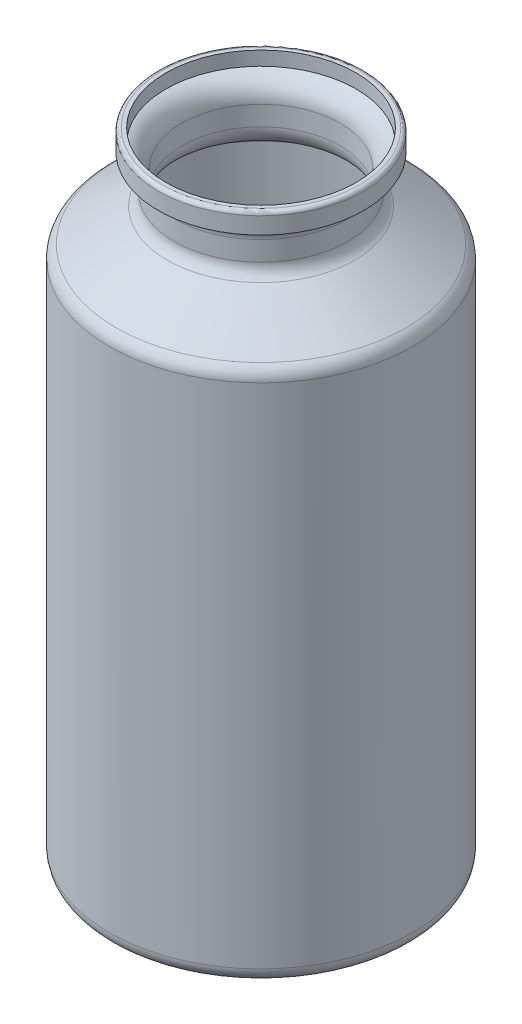
ISO-10303-21;
HEADER;
FILE_DESCRIPTION(('STEP AP214'),'2;1');
FILE_NAME('part.step','',(''),(''),'','','');
FILE_SCHEMA(('AUTOMOTIVE_DESIGN { 1 0 10303 214 1 1 1 1 }'));
ENDSEC;
DATA;
#1=APPLICATION_CONTEXT('core data for automotive mechanical design processes');
#2=APPLICATION_PROTOCOL_DEFINITION('international standard','automotive_design',2000,#1);
#3=PRODUCT_CONTEXT('',#1,'mechanical');
#4=PRODUCT('Part','Part','',(#3));
#5=PRODUCT_RELATED_PRODUCT_CATEGORY('part','',(#4));
#6=PRODUCT_DEFINITION_FORMATION('','',#4);
#7=PRODUCT_DEFINITION_CONTEXT('part definition',#1,'design');
#8=PRODUCT_DEFINITION('design','',#6,#7);
#9=PRODUCT_DEFINITION_SHAPE('','',#8);
#10=(LENGTH_UNIT() NAMED_UNIT(*) SI_UNIT(.MILLI.,.METRE.));
#11=(NAMED_UNIT(*) PLANE_ANGLE_UNIT() SI_UNIT($,.RADIAN.));
#12=(NAMED_UNIT(*) SI_UNIT($,.STERADIAN.) SOLID_ANGLE_UNIT());
#13=UNCERTAINTY_MEASURE_WITH_UNIT(LENGTH_MEASURE(1.E-05),#10,'distance_accuracy_value','');
#14=(GEOMETRIC_REPRESENTATION_CONTEXT(3) GLOBAL_UNCERTAINTY_ASSIGNED_CONTEXT((#13)) GLOBAL_UNIT_ASSIGNED_CONTEXT((#10,
#11,#12)) REPRESENTATION_CONTEXT('',''));
#15=CARTESIAN_POINT('',(0.,0.,0.));
#16=DIRECTION('',(0.,0.,1.));
#17=DIRECTION('',(1.,0.,0.));
#18=AXIS2_PLACEMENT_3D('',#15,#16,#17);
#19=CARTESIAN_POINT('',(0.,-74.1935483870968,0.));
#20=DIRECTION('',(0.,-1.,0.));
#21=DIRECTION('',(0.,0.,-1.));
#22=AXIS2_PLACEMENT_3D('',#19,#20,#21);
#23=CYLINDRICAL_SURFACE('',#22,40.);
#24=CARTESIAN_POINT('',(0.,63.6314493791361,0.));
#25=DIRECTION('',(0.,1.,0.));
#26=DIRECTION('',(0.,0.,1.));
#27=AXIS2_PLACEMENT_3D('',#24,#25,#26);
#28=CIRCLE('',#27,40.);
#29=CARTESIAN_POINT('',(0.,63.6314493791361,40.));
#30=VERTEX_POINT('',#29);
#31=EDGE_CURVE('E61',#30,#30,#28,.F.);
#32=ORIENTED_EDGE('',*,*,#31,.T.);
#33=EDGE_LOOP('',(#32));
#34=FACE_BOUND('',#33,.T.);
#35=CARTESIAN_POINT('',(0.,-70.1935483870968,0.));
#36=DIRECTION('',(0.,-1.,0.));
#37=DIRECTION('',(0.,0.,-1.));
#38=AXIS2_PLACEMENT_3D('',#35,#36,#37);
#39=CIRCLE('',#38,40.);
#40=CARTESIAN_POINT('',(0.,-70.1935483870968,-40.));
#41=VERTEX_POINT('',#40);
#42=EDGE_CURVE('E67',#41,#41,#39,.F.);
#43=ORIENTED_EDGE('',*,*,#42,.T.);
#44=EDGE_LOOP('',(#43));
#45=FACE_BOUND('',#44,.T.);
#46=ADVANCED_FACE('F43',(#34,#45),#23,.T.);
#47=CARTESIAN_POINT('',(0.,65.8064516129032,0.));
#48=DIRECTION('',(0.,-1.,0.));
#49=DIRECTION('',(0.,0.,-1.));
#50=AXIS2_PLACEMENT_3D('',#47,#48,#49);
#51=CONICAL_SURFACE('',#50,40.,0.996065034323137);
#52=CARTESIAN_POINT('',(0.,75.7109418218179,0.));
#53=DIRECTION('',(0.,-1.,0.));
#54=DIRECTION('',(0.,0.,-1.));
#55=AXIS2_PLACEMENT_3D('',#52,#53,#54);
#56=CIRCLE('',#55,24.7073635204609);
#57=CARTESIAN_POINT('',(0.,75.7109418218179,-24.7073635204609));
#58=VERTEX_POINT('',#57);
#59=EDGE_CURVE('E71',#58,#58,#56,.T.);
#60=ORIENTED_EDGE('',*,*,#59,.T.);
#61=EDGE_LOOP('',(#60));
#62=FACE_BOUND('',#61,.T.);
#63=CARTESIAN_POINT('',(0.,66.9888029976356,0.));
#64=DIRECTION('',(0.,1.,0.));
#65=DIRECTION('',(0.,0.,1.));
#66=AXIS2_PLACEMENT_3D('',#63,#64,#65);
#67=CIRCLE('',#66,38.1744370950544);
#68=CARTESIAN_POINT('',(0.,66.9888029976356,38.1744370950544));
#69=VERTEX_POINT('',#68);
#70=EDGE_CURVE('E75',#69,#69,#67,.T.);
#71=ORIENTED_EDGE('',*,*,#70,.T.);
#72=EDGE_LOOP('',(#71));
#73=FACE_BOUND('',#72,.T.);
#74=ADVANCED_FACE('F164',(#62,#73),#51,.T.);
#75=CARTESIAN_POINT('',(0.,-74.1935483870968,0.));
#76=DIRECTION('',(0.,-1.,0.));
#77=DIRECTION('',(0.,0.,-1.));
#78=AXIS2_PLACEMENT_3D('',#75,#76,#77);
#79=CYLINDRICAL_SURFACE('',#78,22.8818006155153);
#80=CARTESIAN_POINT('',(0.,84.2281667121134,0.));
#81=DIRECTION('',(0.,-1.,0.));
#82=DIRECTION('',(0.,0.,-1.));
#83=AXIS2_PLACEMENT_3D('',#80,#81,#82);
#84=CIRCLE('',#83,22.8818006155153);
#85=CARTESIAN_POINT('',(0.,84.2281667121134,-22.8818006155153));
#86=VERTEX_POINT('',#85);
#87=EDGE_CURVE('E83',#86,#86,#84,.T.);
#88=ORIENTED_EDGE('',*,*,#87,.T.);
#89=EDGE_LOOP('',(#88));
#90=FACE_BOUND('',#89,.T.);
#91=CARTESIAN_POINT('',(0.,79.0682954403173,0.));
#92=DIRECTION('',(0.,-1.,0.));
#93=DIRECTION('',(0.,0.,-1.));
#94=AXIS2_PLACEMENT_3D('',#91,#92,#93);
#95=CIRCLE('',#94,22.8818006155153);
#96=CARTESIAN_POINT('',(0.,79.0682954403173,-22.8818006155153));
#97=VERTEX_POINT('',#96);
#98=EDGE_CURVE('E87',#97,#97,#95,.F.);
#99=ORIENTED_EDGE('',*,*,#98,.T.);
#100=EDGE_LOOP('',(#99));
#101=FACE_BOUND('',#100,.T.);
#102=ADVANCED_FACE('F170',(#90,#101),#79,.T.);
#103=CARTESIAN_POINT('',(22.8818006155153,88.2281667121134,0.));
#104=DIRECTION('',(0.,-1.,0.));
#105=DIRECTION('',(0.,0.,-1.));
#106=AXIS2_PLACEMENT_3D('',#103,#104,#105);
#107=PLANE('',#106);
#108=CARTESIAN_POINT('',(0.,88.2281667121134,0.));
#109=DIRECTION('',(0.,-1.,0.));
#110=DIRECTION('',(0.,0.,-1.));
#111=AXIS2_PLACEMENT_3D('',#108,#109,#110);
#112=CIRCLE('',#111,26.8818006155153);
#113=CARTESIAN_POINT('',(0.,88.2281667121134,-26.8818006155153));
#114=VERTEX_POINT('',#113);
#115=EDGE_CURVE('E79',#114,#114,#112,.F.);
#116=ORIENTED_EDGE('',*,*,#115,.T.);
#117=EDGE_LOOP('',(#116));
#118=FACE_BOUND('',#117,.T.);
#119=CARTESIAN_POINT('',(0.,88.2281667121134,0.));
#120=DIRECTION('',(0.,-1.,0.));
#121=DIRECTION('',(0.,0.,-1.));
#122=AXIS2_PLACEMENT_3D('',#119,#120,#121);
#123=CIRCLE('',#122,27.0669846791079);
#124=CARTESIAN_POINT('',(0.,88.2281667121134,-27.0669846791079));
#125=VERTEX_POINT('',#124);
#126=EDGE_CURVE('E91',#125,#125,#123,.T.);
#127=ORIENTED_EDGE('',*,*,#126,.T.);
#128=EDGE_LOOP('',(#127));
#129=FACE_BOUND('',#128,.T.);
#130=ADVANCED_FACE('F211',(#118,#129),#107,.T.);
#131=CARTESIAN_POINT('',(0.,-74.1935483870968,0.));
#132=DIRECTION('',(0.,-1.,0.));
#133=DIRECTION('',(0.,0.,-1.));
#134=AXIS2_PLACEMENT_3D('',#131,#132,#133);
#135=CYLINDRICAL_SURFACE('',#134,27.0669846791079);
#136=CARTESIAN_POINT('',(0.,92.6340294609205,0.));
#137=DIRECTION('',(0.,1.,0.));
#138=DIRECTION('',(0.,0.,1.));
#139=AXIS2_PLACEMENT_3D('',#136,#137,#138);
#140=CIRCLE('',#139,27.0669846791079);
#141=CARTESIAN_POINT('',(0.,92.6340294609205,27.0669846791079));
#142=VERTEX_POINT('',#141);
#143=EDGE_CURVE('E51',#142,#142,#140,.F.);
#144=ORIENTED_EDGE('',*,*,#143,.T.);
#145=EDGE_LOOP('',(#144));
#146=FACE_BOUND('',#145,.T.);
#147=ORIENTED_EDGE('',*,*,#126,.F.);
#148=EDGE_LOOP('',(#147));
#149=FACE_BOUND('',#148,.T.);
#150=ADVANCED_FACE('F205',(#146,#149),#135,.T.);
#151=CARTESIAN_POINT('',(0.,93.6340294609205,0.));
#152=DIRECTION('',(0.,1.,0.));
#153=DIRECTION('',(0.,0.,1.));
#154=AXIS2_PLACEMENT_3D('',#151,#152,#153);
#155=PLANE('',#154);
#156=CARTESIAN_POINT('',(0.,93.6340294609205,0.));
#157=DIRECTION('',(0.,1.,0.));
#158=DIRECTION('',(0.,0.,1.));
#159=AXIS2_PLACEMENT_3D('',#156,#157,#158);
#160=CIRCLE('',#159,25.0669846791079);
#161=CARTESIAN_POINT('',(0.,93.6340294609205,25.0669846791079));
#162=VERTEX_POINT('',#161);
#163=EDGE_CURVE('E95',#162,#162,#160,.F.);
#164=ORIENTED_EDGE('',*,*,#163,.T.);
#165=EDGE_LOOP('',(#164));
#166=FACE_BOUND('',#165,.T.);
#167=CARTESIAN_POINT('',(0.,93.6340294609205,0.));
#168=DIRECTION('',(0.,1.,0.));
#169=DIRECTION('',(0.,0.,1.));
#170=AXIS2_PLACEMENT_3D('',#167,#168,#169);
#171=CIRCLE('',#170,26.0669846791079);
#172=CARTESIAN_POINT('',(0.,93.6340294609205,26.0669846791079));
#173=VERTEX_POINT('',#172);
#174=EDGE_CURVE('E12',#173,#173,#171,.T.);
#175=ORIENTED_EDGE('',*,*,#174,.T.);
#176=EDGE_LOOP('',(#175));
#177=FACE_BOUND('',#176,.T.);
#178=ADVANCED_FACE('F200',(#166,#177),#155,.T.);
#179=CARTESIAN_POINT('',(0.,-74.1935483870968,0.));
#180=DIRECTION('',(0.,-1.,0.));
#181=DIRECTION('',(0.,0.,-1.));
#182=AXIS2_PLACEMENT_3D('',#179,#180,#181);
#183=PLANE('',#182);
#184=CARTESIAN_POINT('',(0.,-74.1935483870968,0.));
#185=DIRECTION('',(0.,-1.,0.));
#186=DIRECTION('',(0.,0.,-1.));
#187=AXIS2_PLACEMENT_3D('',#184,#185,#186);
#188=CIRCLE('',#187,36.);
#189=CARTESIAN_POINT('',(0.,-74.1935483870968,-36.));
#190=VERTEX_POINT('',#189);
#191=EDGE_CURVE('E56',#190,#190,#188,.T.);
#192=ORIENTED_EDGE('',*,*,#191,.T.);
#193=EDGE_LOOP('',(#192));
#194=FACE_BOUND('',#193,.T.);
#195=ADVANCED_FACE('F180',(#194),#183,.T.);
#196=CARTESIAN_POINT('',(0.,84.2281667121134,0.));
#197=DIRECTION('',(0.,-1.,0.));
#198=DIRECTION('',(0.,0.,-1.));
#199=AXIS2_PLACEMENT_3D('',#196,#197,#198);
#200=TOROIDAL_SURFACE('',#199,26.8818006155153,4.);
#201=ORIENTED_EDGE('',*,*,#115,.F.);
#202=EDGE_LOOP('',(#201));
#203=FACE_BOUND('',#202,.T.);
#204=ORIENTED_EDGE('',*,*,#87,.F.);
#205=EDGE_LOOP('',(#204));
#206=FACE_BOUND('',#205,.T.);
#207=ADVANCED_FACE('F176',(#203,#206),#200,.F.);
#208=CARTESIAN_POINT('',(0.,79.0682954403173,0.));
#209=DIRECTION('',(0.,-1.,0.));
#210=DIRECTION('',(0.,0.,-1.));
#211=AXIS2_PLACEMENT_3D('',#208,#209,#210);
#212=TOROIDAL_SURFACE('',#211,26.8818006155153,4.);
#213=ORIENTED_EDGE('',*,*,#98,.F.);
#214=EDGE_LOOP('',(#213));
#215=FACE_BOUND('',#214,.T.);
#216=ORIENTED_EDGE('',*,*,#59,.F.);
#217=EDGE_LOOP('',(#216));
#218=FACE_BOUND('',#217,.T.);
#219=ADVANCED_FACE('F179',(#215,#218),#212,.F.);
#220=CARTESIAN_POINT('',(0.,63.6314493791361,0.));
#221=DIRECTION('',(0.,1.,0.));
#222=DIRECTION('',(0.,0.,1.));
#223=AXIS2_PLACEMENT_3D('',#220,#221,#222);
#224=TOROIDAL_SURFACE('',#223,36.,4.);
#225=ORIENTED_EDGE('',*,*,#70,.F.);
#226=EDGE_LOOP('',(#225));
#227=FACE_BOUND('',#226,.T.);
#228=ORIENTED_EDGE('',*,*,#31,.F.);
#229=EDGE_LOOP('',(#228));
#230=FACE_BOUND('',#229,.T.);
#231=ADVANCED_FACE('F184',(#227,#230),#224,.T.);
#232=CARTESIAN_POINT('',(0.,-70.1935483870968,0.));
#233=DIRECTION('',(0.,-1.,0.));
#234=DIRECTION('',(0.,0.,-1.));
#235=AXIS2_PLACEMENT_3D('',#232,#233,#234);
#236=TOROIDAL_SURFACE('',#235,36.,4.);
#237=ORIENTED_EDGE('',*,*,#42,.F.);
#238=EDGE_LOOP('',(#237));
#239=FACE_BOUND('',#238,.T.);
#240=ORIENTED_EDGE('',*,*,#191,.F.);
#241=EDGE_LOOP('',(#240));
#242=FACE_BOUND('',#241,.T.);
#243=ADVANCED_FACE('F187',(#239,#242),#236,.T.);
#244=CARTESIAN_POINT('',(0.,92.6340294609205,0.));
#245=DIRECTION('',(0.,1.,0.));
#246=DIRECTION('',(0.,0.,1.));
#247=AXIS2_PLACEMENT_3D('',#244,#245,#246);
#248=TOROIDAL_SURFACE('',#247,26.0669846791079,1.);
#249=ORIENTED_EDGE('',*,*,#174,.F.);
#250=EDGE_LOOP('',(#249));
#251=FACE_BOUND('',#250,.T.);
#252=ORIENTED_EDGE('',*,*,#143,.F.);
#253=EDGE_LOOP('',(#252));
#254=FACE_BOUND('',#253,.T.);
#255=ADVANCED_FACE('F45',(#251,#254),#248,.T.);
#256=CARTESIAN_POINT('',(0.,-74.1935483870968,0.));
#257=DIRECTION('',(0.,-1.,0.));
#258=DIRECTION('',(0.,0.,-1.));
#259=AXIS2_PLACEMENT_3D('',#256,#257,#258);
#260=CYLINDRICAL_SURFACE('',#259,38.);
#261=CARTESIAN_POINT('',(0.,63.6314493791361,0.));
#262=DIRECTION('',(0.,-1.,0.));
#263=DIRECTION('',(0.,0.,-1.));
#264=AXIS2_PLACEMENT_3D('',#261,#262,#263);
#265=CIRCLE('',#264,38.);
#266=CARTESIAN_POINT('',(0.,63.6314493791361,-38.));
#267=VERTEX_POINT('',#266);
#268=EDGE_CURVE('E109',#267,#267,#265,.T.);
#269=ORIENTED_EDGE('',*,*,#268,.F.);
#270=EDGE_LOOP('',(#269));
#271=FACE_BOUND('',#270,.T.);
#272=CARTESIAN_POINT('',(0.,-70.1935483870968,0.));
#273=DIRECTION('',(0.,-1.,0.));
#274=DIRECTION('',(0.,0.,-1.));
#275=AXIS2_PLACEMENT_3D('',#272,#273,#274);
#276=CIRCLE('',#275,38.);
#277=CARTESIAN_POINT('',(0.,-70.1935483870968,-38.));
#278=VERTEX_POINT('',#277);
#279=EDGE_CURVE('E121',#278,#278,#276,.F.);
#280=ORIENTED_EDGE('',*,*,#279,.F.);
#281=EDGE_LOOP('',(#280));
#282=FACE_BOUND('',#281,.T.);
#283=ADVANCED_FACE('F134',(#271,#282),#260,.F.);
#284=CARTESIAN_POINT('',(0.,64.1277748036535,0.));
#285=DIRECTION('',(0.,-1.,0.));
#286=DIRECTION('',(0.,0.,-1.));
#287=AXIS2_PLACEMENT_3D('',#284,#285,#286);
#288=CONICAL_SURFACE('',#287,38.9127814524728,0.996065034323137);
#289=CARTESIAN_POINT('',(0.,74.0322650125682,0.));
#290=DIRECTION('',(0.,-1.,0.));
#291=DIRECTION('',(0.,0.,-1.));
#292=AXIS2_PLACEMENT_3D('',#289,#290,#291);
#293=CIRCLE('',#292,23.6201449729337);
#294=CARTESIAN_POINT('',(0.,74.0322650125682,-23.6201449729337));
#295=VERTEX_POINT('',#294);
#296=EDGE_CURVE('E117',#295,#295,#293,.T.);
#297=ORIENTED_EDGE('',*,*,#296,.F.);
#298=EDGE_LOOP('',(#297));
#299=FACE_BOUND('',#298,.T.);
#300=CARTESIAN_POINT('',(0.,65.3101261883859,0.));
#301=DIRECTION('',(0.,-1.,0.));
#302=DIRECTION('',(0.,0.,-1.));
#303=AXIS2_PLACEMENT_3D('',#300,#301,#302);
#304=CIRCLE('',#303,37.0872185475272);
#305=CARTESIAN_POINT('',(0.,65.3101261883859,-37.0872185475272));
#306=VERTEX_POINT('',#305);
#307=EDGE_CURVE('E100',#306,#306,#304,.F.);
#308=ORIENTED_EDGE('',*,*,#307,.F.);
#309=EDGE_LOOP('',(#308));
#310=FACE_BOUND('',#309,.T.);
#311=ADVANCED_FACE('F137',(#299,#310),#288,.F.);
#312=CARTESIAN_POINT('',(0.,-74.1935483870968,0.));
#313=DIRECTION('',(0.,-1.,0.));
#314=DIRECTION('',(0.,0.,-1.));
#315=AXIS2_PLACEMENT_3D('',#312,#313,#314);
#316=CYLINDRICAL_SURFACE('',#315,20.8818006155153);
#317=CARTESIAN_POINT('',(0.,84.2281667121134,0.));
#318=DIRECTION('',(0.,-1.,0.));
#319=DIRECTION('',(0.,0.,-1.));
#320=AXIS2_PLACEMENT_3D('',#317,#318,#319);
#321=CIRCLE('',#320,20.8818006155153);
#322=CARTESIAN_POINT('',(0.,84.2281667121134,-20.8818006155153));
#323=VERTEX_POINT('',#322);
#324=EDGE_CURVE('E101',#323,#323,#321,.T.);
#325=ORIENTED_EDGE('',*,*,#324,.F.);
#326=EDGE_LOOP('',(#325));
#327=FACE_BOUND('',#326,.T.);
#328=CARTESIAN_POINT('',(0.,79.0682954403173,0.));
#329=DIRECTION('',(0.,-1.,0.));
#330=DIRECTION('',(0.,0.,-1.));
#331=AXIS2_PLACEMENT_3D('',#328,#329,#330);
#332=CIRCLE('',#331,20.8818006155153);
#333=CARTESIAN_POINT('',(0.,79.0682954403173,-20.8818006155153));
#334=VERTEX_POINT('',#333);
#335=EDGE_CURVE('E113',#334,#334,#332,.F.);
#336=ORIENTED_EDGE('',*,*,#335,.F.);
#337=EDGE_LOOP('',(#336));
#338=FACE_BOUND('',#337,.T.);
#339=ADVANCED_FACE('F159',(#327,#338),#316,.F.);
#340=CARTESIAN_POINT('',(0.,-74.1935483870968,0.));
#341=DIRECTION('',(0.,-1.,0.));
#342=DIRECTION('',(0.,0.,-1.));
#343=AXIS2_PLACEMENT_3D('',#340,#341,#342);
#344=CYLINDRICAL_SURFACE('',#343,25.0669846791079);
#345=ORIENTED_EDGE('',*,*,#163,.F.);
#346=EDGE_LOOP('',(#345));
#347=FACE_BOUND('',#346,.T.);
#348=CARTESIAN_POINT('',(0.,89.9471214345222,0.));
#349=DIRECTION('',(0.,-1.,0.));
#350=DIRECTION('',(0.,0.,-1.));
#351=AXIS2_PLACEMENT_3D('',#348,#349,#350);
#352=CIRCLE('',#351,25.0669846791079);
#353=CARTESIAN_POINT('',(0.,89.9471214345222,-25.0669846791079));
#354=VERTEX_POINT('',#353);
#355=EDGE_CURVE('E96',#354,#354,#352,.F.);
#356=ORIENTED_EDGE('',*,*,#355,.F.);
#357=EDGE_LOOP('',(#356));
#358=FACE_BOUND('',#357,.T.);
#359=ADVANCED_FACE('F150',(#347,#358),#344,.F.);
#360=CARTESIAN_POINT('',(0.,-72.1935483870968,0.));
#361=DIRECTION('',(0.,-1.,0.));
#362=DIRECTION('',(0.,0.,-1.));
#363=AXIS2_PLACEMENT_3D('',#360,#361,#362);
#364=PLANE('',#363);
#365=CARTESIAN_POINT('',(0.,-72.1935483870968,0.));
#366=DIRECTION('',(0.,-1.,0.));
#367=DIRECTION('',(0.,0.,-1.));
#368=AXIS2_PLACEMENT_3D('',#365,#366,#367);
#369=CIRCLE('',#368,36.);
#370=CARTESIAN_POINT('',(0.,-72.1935483870968,-36.));
#371=VERTEX_POINT('',#370);
#372=EDGE_CURVE('E105',#371,#371,#369,.T.);
#373=ORIENTED_EDGE('',*,*,#372,.F.);
#374=EDGE_LOOP('',(#373));
#375=FACE_BOUND('',#374,.T.);
#376=ADVANCED_FACE('F147',(#375),#364,.F.);
#377=CARTESIAN_POINT('',(0.,84.2281667121134,0.));
#378=DIRECTION('',(0.,-1.,0.));
#379=DIRECTION('',(0.,0.,-1.));
#380=AXIS2_PLACEMENT_3D('',#377,#378,#379);
#381=TOROIDAL_SURFACE('',#380,26.8818006155153,6.);
#382=ORIENTED_EDGE('',*,*,#355,.T.);
#383=EDGE_LOOP('',(#382));
#384=FACE_BOUND('',#383,.T.);
#385=ORIENTED_EDGE('',*,*,#324,.T.);
#386=EDGE_LOOP('',(#385));
#387=FACE_BOUND('',#386,.T.);
#388=ADVANCED_FACE('F149',(#384,#387),#381,.T.);
#389=CARTESIAN_POINT('',(0.,79.0682954403173,0.));
#390=DIRECTION('',(0.,-1.,0.));
#391=DIRECTION('',(0.,0.,-1.));
#392=AXIS2_PLACEMENT_3D('',#389,#390,#391);
#393=TOROIDAL_SURFACE('',#392,26.8818006155153,6.);
#394=ORIENTED_EDGE('',*,*,#335,.T.);
#395=EDGE_LOOP('',(#394));
#396=FACE_BOUND('',#395,.T.);
#397=ORIENTED_EDGE('',*,*,#296,.T.);
#398=EDGE_LOOP('',(#397));
#399=FACE_BOUND('',#398,.T.);
#400=ADVANCED_FACE('F156',(#396,#399),#393,.T.);
#401=CARTESIAN_POINT('',(0.,63.6314493791361,0.));
#402=DIRECTION('',(0.,1.,0.));
#403=DIRECTION('',(0.,0.,1.));
#404=AXIS2_PLACEMENT_3D('',#401,#402,#403);
#405=TOROIDAL_SURFACE('',#404,36.,2.);
#406=ORIENTED_EDGE('',*,*,#307,.T.);
#407=EDGE_LOOP('',(#406));
#408=FACE_BOUND('',#407,.T.);
#409=ORIENTED_EDGE('',*,*,#268,.T.);
#410=EDGE_LOOP('',(#409));
#411=FACE_BOUND('',#410,.T.);
#412=ADVANCED_FACE('F132',(#408,#411),#405,.F.);
#413=CARTESIAN_POINT('',(0.,-70.1935483870968,0.));
#414=DIRECTION('',(0.,-1.,0.));
#415=DIRECTION('',(0.,0.,-1.));
#416=AXIS2_PLACEMENT_3D('',#413,#414,#415);
#417=TOROIDAL_SURFACE('',#416,36.,2.);
#418=ORIENTED_EDGE('',*,*,#279,.T.);
#419=EDGE_LOOP('',(#418));
#420=FACE_BOUND('',#419,.T.);
#421=ORIENTED_EDGE('',*,*,#372,.T.);
#422=EDGE_LOOP('',(#421));
#423=FACE_BOUND('',#422,.T.);
#424=ADVANCED_FACE('F141',(#420,#423),#417,.F.);
#425=CLOSED_SHELL('',(#46,#74,#102,#130,#150,#178,#195,#207,#219,#231,#243,#255,#283,#311,#339,
#359,#376,#388,#400,#412,#424));
#426=MANIFOLD_SOLID_BREP('B2',#425);
#427=ADVANCED_BREP_SHAPE_REPRESENTATION('',(#18,#426),#14);
#428=SHAPE_DEFINITION_REPRESENTATION(#9,#427);
ENDSEC;
END-ISO-10303-21;
